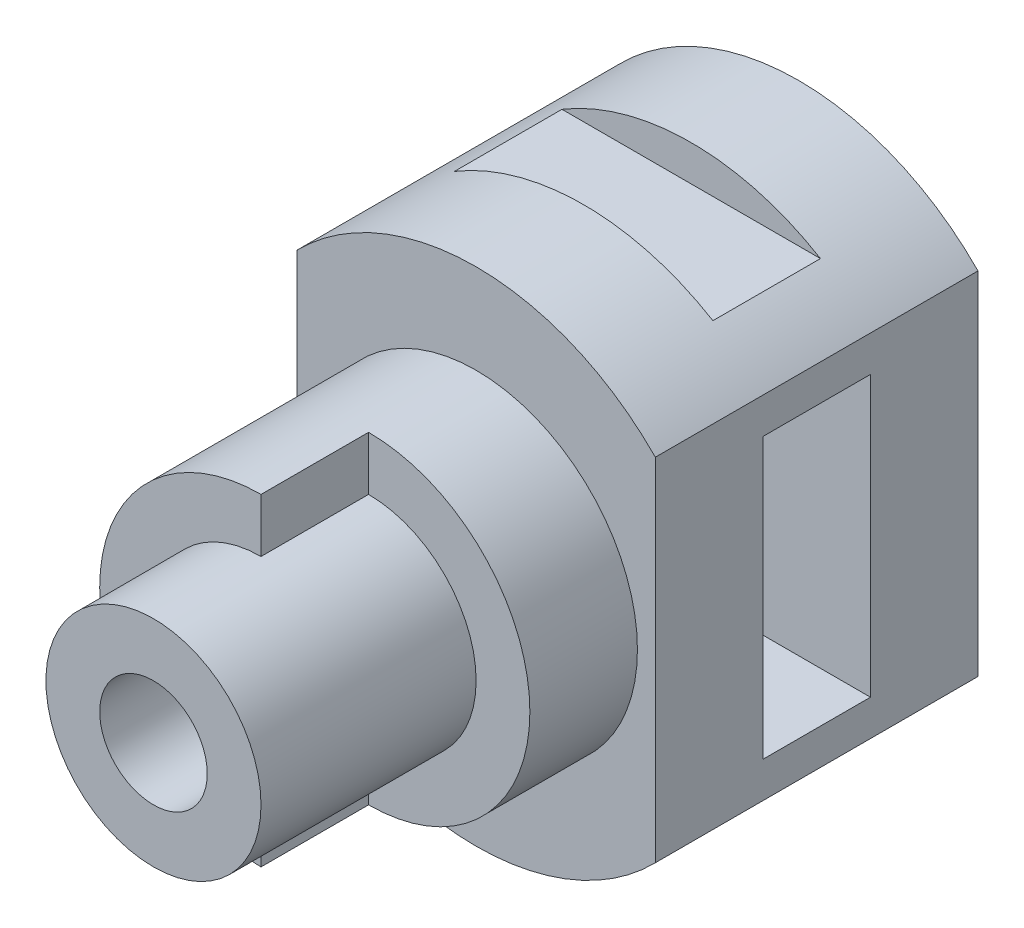
ISO-10303-21;
HEADER;
FILE_DESCRIPTION(('STEP AP214'),'2;1');
FILE_NAME('part.step','',(''),(''),'','','');
FILE_SCHEMA(('AUTOMOTIVE_DESIGN { 1 0 10303 214 1 1 1 1 }'));
ENDSEC;
DATA;
#1=APPLICATION_CONTEXT('core data for automotive mechanical design processes');
#2=APPLICATION_PROTOCOL_DEFINITION('international standard','automotive_design',2000,#1);
#3=PRODUCT_CONTEXT('',#1,'mechanical');
#4=PRODUCT('Part','Part','',(#3));
#5=PRODUCT_RELATED_PRODUCT_CATEGORY('part','',(#4));
#6=PRODUCT_DEFINITION_FORMATION('','',#4);
#7=PRODUCT_DEFINITION_CONTEXT('part definition',#1,'design');
#8=PRODUCT_DEFINITION('design','',#6,#7);
#9=PRODUCT_DEFINITION_SHAPE('','',#8);
#10=(LENGTH_UNIT() NAMED_UNIT(*) SI_UNIT(.MILLI.,.METRE.));
#11=(NAMED_UNIT(*) PLANE_ANGLE_UNIT() SI_UNIT($,.RADIAN.));
#12=(NAMED_UNIT(*) SI_UNIT($,.STERADIAN.) SOLID_ANGLE_UNIT());
#13=UNCERTAINTY_MEASURE_WITH_UNIT(LENGTH_MEASURE(1.E-05),#10,'distance_accuracy_value','');
#14=(GEOMETRIC_REPRESENTATION_CONTEXT(3) GLOBAL_UNCERTAINTY_ASSIGNED_CONTEXT((#13)) GLOBAL_UNIT_ASSIGNED_CONTEXT((#10,
#11,#12)) REPRESENTATION_CONTEXT('',''));
#15=CARTESIAN_POINT('',(0.,0.,0.));
#16=DIRECTION('',(0.,0.,1.));
#17=DIRECTION('',(1.,0.,0.));
#18=AXIS2_PLACEMENT_3D('',#15,#16,#17);
#19=CARTESIAN_POINT('',(5.,0.,9.));
#20=DIRECTION('',(-1.,0.,0.));
#21=DIRECTION('',(0.,0.,1.));
#22=AXIS2_PLACEMENT_3D('',#19,#20,#21);
#23=PLANE('',#22);
#24=DIRECTION('',(0.,1.,0.));
#25=VECTOR('',#24,1.);
#26=CARTESIAN_POINT('',(5.,0.,0.));
#27=LINE('',#26,#25);
#28=CARTESIAN_POINT('',(5.,-4.89897948556636,0.));
#29=VERTEX_POINT('',#28);
#30=CARTESIAN_POINT('',(5.,4.89897948556636,0.));
#31=VERTEX_POINT('',#30);
#32=EDGE_CURVE('E241',#29,#31,#27,.T.);
#33=ORIENTED_EDGE('',*,*,#32,.T.);
#34=DIRECTION('',(0.,0.,-1.));
#35=VECTOR('',#34,1.);
#36=CARTESIAN_POINT('',(5.,4.89897948556636,9.));
#37=LINE('',#36,#35);
#38=CARTESIAN_POINT('',(5.,4.89897948556636,9.));
#39=VERTEX_POINT('',#38);
#40=EDGE_CURVE('E266',#39,#31,#37,.T.);
#41=ORIENTED_EDGE('',*,*,#40,.F.);
#42=DIRECTION('',(0.,1.,0.));
#43=VECTOR('',#42,1.);
#44=CARTESIAN_POINT('',(5.,0.,9.));
#45=LINE('',#44,#43);
#46=CARTESIAN_POINT('',(5.,-4.89897948556636,9.));
#47=VERTEX_POINT('',#46);
#48=EDGE_CURVE('E242',#47,#39,#45,.T.);
#49=ORIENTED_EDGE('',*,*,#48,.F.);
#50=DIRECTION('',(0.,0.,-1.));
#51=VECTOR('',#50,1.);
#52=CARTESIAN_POINT('',(5.,-4.89897948556636,9.));
#53=LINE('',#52,#51);
#54=EDGE_CURVE('E257',#47,#29,#53,.T.);
#55=ORIENTED_EDGE('',*,*,#54,.T.);
#56=EDGE_LOOP('',(#33,#41,#49,#55));
#57=FACE_BOUND('',#56,.T.);
#58=DIRECTION('',(0.,-1.,0.));
#59=VECTOR('',#58,1.);
#60=CARTESIAN_POINT('',(5.,0.,6.));
#61=LINE('',#60,#59);
#62=CARTESIAN_POINT('',(5.,3.89897948556636,6.));
#63=VERTEX_POINT('',#62);
#64=CARTESIAN_POINT('',(5.,-3.89897948556636,6.));
#65=VERTEX_POINT('',#64);
#66=EDGE_CURVE('E239',#63,#65,#61,.T.);
#67=ORIENTED_EDGE('',*,*,#66,.F.);
#68=DIRECTION('',(0.,0.,1.));
#69=VECTOR('',#68,1.);
#70=CARTESIAN_POINT('',(5.,3.89897948556636,9.));
#71=LINE('',#70,#69);
#72=CARTESIAN_POINT('',(5.,3.89897948556636,3.));
#73=VERTEX_POINT('',#72);
#74=EDGE_CURVE('E203',#73,#63,#71,.T.);
#75=ORIENTED_EDGE('',*,*,#74,.F.);
#76=DIRECTION('',(0.,-1.,0.));
#77=VECTOR('',#76,1.);
#78=CARTESIAN_POINT('',(5.,0.,3.));
#79=LINE('',#78,#77);
#80=CARTESIAN_POINT('',(5.,-3.89897948556636,3.));
#81=VERTEX_POINT('',#80);
#82=EDGE_CURVE('E233',#73,#81,#79,.T.);
#83=ORIENTED_EDGE('',*,*,#82,.T.);
#84=DIRECTION('',(0.,0.,1.));
#85=VECTOR('',#84,1.);
#86=CARTESIAN_POINT('',(5.,-3.89897948556636,9.));
#87=LINE('',#86,#85);
#88=EDGE_CURVE('E236',#81,#65,#87,.T.);
#89=ORIENTED_EDGE('',*,*,#88,.T.);
#90=EDGE_LOOP('',(#67,#75,#83,#89));
#91=FACE_BOUND('',#90,.T.);
#92=ADVANCED_FACE('F35',(#57,#91),#23,.F.);
#93=CARTESIAN_POINT('',(0.,0.,9.));
#94=DIRECTION('',(0.,0.,-1.));
#95=DIRECTION('',(-1.,0.,0.));
#96=AXIS2_PLACEMENT_3D('',#93,#94,#95);
#97=CYLINDRICAL_SURFACE('',#96,7.);
#98=CARTESIAN_POINT('',(0.,0.,0.));
#99=DIRECTION('',(0.,0.,1.));
#100=DIRECTION('',(1.,0.,0.));
#101=AXIS2_PLACEMENT_3D('',#98,#99,#100);
#102=CIRCLE('',#101,7.);
#103=CARTESIAN_POINT('',(-5.,4.89897948556636,0.));
#104=VERTEX_POINT('',#103);
#105=EDGE_CURVE('E253',#31,#104,#102,.T.);
#106=ORIENTED_EDGE('',*,*,#105,.T.);
#107=DIRECTION('',(0.,0.,-1.));
#108=VECTOR('',#107,1.);
#109=CARTESIAN_POINT('',(-5.,4.89897948556636,9.));
#110=LINE('',#109,#108);
#111=CARTESIAN_POINT('',(-5.,4.89897948556636,9.));
#112=VERTEX_POINT('',#111);
#113=EDGE_CURVE('E263',#112,#104,#110,.T.);
#114=ORIENTED_EDGE('',*,*,#113,.F.);
#115=CARTESIAN_POINT('',(0.,0.,9.));
#116=DIRECTION('',(0.,0.,1.));
#117=DIRECTION('',(1.,0.,0.));
#118=AXIS2_PLACEMENT_3D('',#115,#116,#117);
#119=CIRCLE('',#118,7.);
#120=EDGE_CURVE('E245',#39,#112,#119,.T.);
#121=ORIENTED_EDGE('',*,*,#120,.F.);
#122=ORIENTED_EDGE('',*,*,#40,.T.);
#123=EDGE_LOOP('',(#106,#114,#121,#122));
#124=FACE_BOUND('',#123,.T.);
#125=DIRECTION('',(0.,0.,-1.));
#126=VECTOR('',#125,1.);
#127=CARTESIAN_POINT('',(-3.60555127546399,6.,9.));
#128=LINE('',#127,#126);
#129=CARTESIAN_POINT('',(-3.60555127546399,6.,6.));
#130=VERTEX_POINT('',#129);
#131=CARTESIAN_POINT('',(-3.60555127546399,6.,3.));
#132=VERTEX_POINT('',#131);
#133=EDGE_CURVE('E38',#130,#132,#128,.T.);
#134=ORIENTED_EDGE('',*,*,#133,.T.);
#135=CARTESIAN_POINT('',(0.,0.,3.));
#136=DIRECTION('',(0.,0.,-1.));
#137=DIRECTION('',(-1.,0.,0.));
#138=AXIS2_PLACEMENT_3D('',#135,#136,#137);
#139=CIRCLE('',#138,7.);
#140=CARTESIAN_POINT('',(3.60555127546399,6.,3.));
#141=VERTEX_POINT('',#140);
#142=EDGE_CURVE('E280',#132,#141,#139,.T.);
#143=ORIENTED_EDGE('',*,*,#142,.T.);
#144=DIRECTION('',(0.,0.,-1.));
#145=VECTOR('',#144,1.);
#146=CARTESIAN_POINT('',(3.60555127546399,6.,9.));
#147=LINE('',#146,#145);
#148=CARTESIAN_POINT('',(3.60555127546399,6.,6.));
#149=VERTEX_POINT('',#148);
#150=EDGE_CURVE('E283',#141,#149,#147,.F.);
#151=ORIENTED_EDGE('',*,*,#150,.T.);
#152=CARTESIAN_POINT('',(0.,0.,6.));
#153=DIRECTION('',(0.,0.,-1.));
#154=DIRECTION('',(-1.,0.,0.));
#155=AXIS2_PLACEMENT_3D('',#152,#153,#154);
#156=CIRCLE('',#155,7.);
#157=EDGE_CURVE('E285',#130,#149,#156,.T.);
#158=ORIENTED_EDGE('',*,*,#157,.F.);
#159=EDGE_LOOP('',(#134,#143,#151,#158));
#160=FACE_BOUND('',#159,.T.);
#161=ADVANCED_FACE('F291',(#124,#160),#97,.T.);
#162=CARTESIAN_POINT('',(-5.,0.,9.));
#163=DIRECTION('',(1.,0.,0.));
#164=DIRECTION('',(0.,0.,-1.));
#165=AXIS2_PLACEMENT_3D('',#162,#163,#164);
#166=PLANE('',#165);
#167=DIRECTION('',(0.,-1.,0.));
#168=VECTOR('',#167,1.);
#169=CARTESIAN_POINT('',(-5.,0.,0.));
#170=LINE('',#169,#168);
#171=CARTESIAN_POINT('',(-5.,-4.89897948556636,0.));
#172=VERTEX_POINT('',#171);
#173=EDGE_CURVE('E255',#104,#172,#170,.T.);
#174=ORIENTED_EDGE('',*,*,#173,.T.);
#175=DIRECTION('',(0.,0.,-1.));
#176=VECTOR('',#175,1.);
#177=CARTESIAN_POINT('',(-5.,-4.89897948556636,9.));
#178=LINE('',#177,#176);
#179=CARTESIAN_POINT('',(-5.,-4.89897948556636,9.));
#180=VERTEX_POINT('',#179);
#181=EDGE_CURVE('E260',#180,#172,#178,.T.);
#182=ORIENTED_EDGE('',*,*,#181,.F.);
#183=DIRECTION('',(0.,-1.,0.));
#184=VECTOR('',#183,1.);
#185=CARTESIAN_POINT('',(-5.,0.,9.));
#186=LINE('',#185,#184);
#187=EDGE_CURVE('E248',#112,#180,#186,.T.);
#188=ORIENTED_EDGE('',*,*,#187,.F.);
#189=ORIENTED_EDGE('',*,*,#113,.T.);
#190=EDGE_LOOP('',(#174,#182,#188,#189));
#191=FACE_BOUND('',#190,.T.);
#192=DIRECTION('',(0.,-1.,0.));
#193=VECTOR('',#192,1.);
#194=CARTESIAN_POINT('',(-5.,0.,6.));
#195=LINE('',#194,#193);
#196=CARTESIAN_POINT('',(-5.,3.89897948556636,6.));
#197=VERTEX_POINT('',#196);
#198=CARTESIAN_POINT('',(-5.,-3.89897948556636,6.));
#199=VERTEX_POINT('',#198);
#200=EDGE_CURVE('E208',#197,#199,#195,.T.);
#201=ORIENTED_EDGE('',*,*,#200,.T.);
#202=DIRECTION('',(0.,0.,1.));
#203=VECTOR('',#202,1.);
#204=CARTESIAN_POINT('',(-5.,-3.89897948556636,0.));
#205=LINE('',#204,#203);
#206=CARTESIAN_POINT('',(-5.,-3.89897948556636,3.));
#207=VERTEX_POINT('',#206);
#208=EDGE_CURVE('E218',#207,#199,#205,.T.);
#209=ORIENTED_EDGE('',*,*,#208,.F.);
#210=DIRECTION('',(0.,-1.,0.));
#211=VECTOR('',#210,1.);
#212=CARTESIAN_POINT('',(-5.,0.,3.));
#213=LINE('',#212,#211);
#214=CARTESIAN_POINT('',(-5.,3.89897948556636,3.));
#215=VERTEX_POINT('',#214);
#216=EDGE_CURVE('E215',#215,#207,#213,.T.);
#217=ORIENTED_EDGE('',*,*,#216,.F.);
#218=DIRECTION('',(0.,0.,1.));
#219=VECTOR('',#218,1.);
#220=CARTESIAN_POINT('',(-5.,3.89897948556636,0.));
#221=LINE('',#220,#219);
#222=EDGE_CURVE('E211',#215,#197,#221,.T.);
#223=ORIENTED_EDGE('',*,*,#222,.T.);
#224=EDGE_LOOP('',(#201,#209,#217,#223));
#225=FACE_BOUND('',#224,.T.);
#226=ADVANCED_FACE('F314',(#191,#225),#166,.F.);
#227=EDGE_CURVE('E246',#172,#29,#102,.T.);
#228=ORIENTED_EDGE('',*,*,#227,.T.);
#229=ORIENTED_EDGE('',*,*,#54,.F.);
#230=EDGE_CURVE('E249',#180,#47,#119,.T.);
#231=ORIENTED_EDGE('',*,*,#230,.F.);
#232=ORIENTED_EDGE('',*,*,#181,.T.);
#233=EDGE_LOOP('',(#228,#229,#231,#232));
#234=FACE_BOUND('',#233,.T.);
#235=CARTESIAN_POINT('',(0.,0.,3.));
#236=DIRECTION('',(0.,0.,1.));
#237=DIRECTION('',(1.,0.,0.));
#238=AXIS2_PLACEMENT_3D('',#235,#236,#237);
#239=CIRCLE('',#238,7.);
#240=CARTESIAN_POINT('',(-3.60555127546399,-6.,3.));
#241=VERTEX_POINT('',#240);
#242=CARTESIAN_POINT('',(3.60555127546399,-6.,3.));
#243=VERTEX_POINT('',#242);
#244=EDGE_CURVE('E278',#241,#243,#239,.T.);
#245=ORIENTED_EDGE('',*,*,#244,.F.);
#246=DIRECTION('',(0.,0.,-1.));
#247=VECTOR('',#246,1.);
#248=CARTESIAN_POINT('',(-3.60555127546399,-6.,9.));
#249=LINE('',#248,#247);
#250=CARTESIAN_POINT('',(-3.60555127546399,-6.,6.));
#251=VERTEX_POINT('',#250);
#252=EDGE_CURVE('E275',#251,#241,#249,.T.);
#253=ORIENTED_EDGE('',*,*,#252,.F.);
#254=CARTESIAN_POINT('',(0.,0.,6.));
#255=DIRECTION('',(0.,0.,1.));
#256=DIRECTION('',(1.,0.,0.));
#257=AXIS2_PLACEMENT_3D('',#254,#255,#256);
#258=CIRCLE('',#257,7.);
#259=CARTESIAN_POINT('',(3.60555127546399,-6.,6.));
#260=VERTEX_POINT('',#259);
#261=EDGE_CURVE('E269',#251,#260,#258,.T.);
#262=ORIENTED_EDGE('',*,*,#261,.T.);
#263=DIRECTION('',(0.,0.,-1.));
#264=VECTOR('',#263,1.);
#265=CARTESIAN_POINT('',(3.60555127546399,-6.,9.));
#266=LINE('',#265,#264);
#267=EDGE_CURVE('E272',#243,#260,#266,.F.);
#268=ORIENTED_EDGE('',*,*,#267,.F.);
#269=EDGE_LOOP('',(#245,#253,#262,#268));
#270=FACE_BOUND('',#269,.T.);
#271=ADVANCED_FACE('F317',(#234,#270),#97,.T.);
#272=CARTESIAN_POINT('',(0.,0.,9.));
#273=DIRECTION('',(0.,0.,1.));
#274=DIRECTION('',(1.,0.,0.));
#275=AXIS2_PLACEMENT_3D('',#272,#273,#274);
#276=PLANE('',#275);
#277=CARTESIAN_POINT('',(0.,0.,9.));
#278=DIRECTION('',(0.,0.,1.));
#279=DIRECTION('',(1.,0.,0.));
#280=AXIS2_PLACEMENT_3D('',#277,#278,#279);
#281=CIRCLE('',#280,4.5);
#282=CARTESIAN_POINT('',(4.5,0.,9.));
#283=VERTEX_POINT('',#282);
#284=EDGE_CURVE('E43',#283,#283,#281,.T.);
#285=ORIENTED_EDGE('',*,*,#284,.F.);
#286=EDGE_LOOP('',(#285));
#287=FACE_BOUND('',#286,.T.);
#288=ORIENTED_EDGE('',*,*,#48,.T.);
#289=ORIENTED_EDGE('',*,*,#120,.T.);
#290=ORIENTED_EDGE('',*,*,#187,.T.);
#291=ORIENTED_EDGE('',*,*,#230,.T.);
#292=EDGE_LOOP('',(#288,#289,#290,#291));
#293=FACE_BOUND('',#292,.T.);
#294=ADVANCED_FACE('F355',(#287,#293),#276,.T.);
#295=CARTESIAN_POINT('',(0.,0.,0.));
#296=DIRECTION('',(0.,0.,1.));
#297=DIRECTION('',(1.,0.,0.));
#298=AXIS2_PLACEMENT_3D('',#295,#296,#297);
#299=PLANE('',#298);
#300=ORIENTED_EDGE('',*,*,#32,.F.);
#301=ORIENTED_EDGE('',*,*,#227,.F.);
#302=ORIENTED_EDGE('',*,*,#173,.F.);
#303=ORIENTED_EDGE('',*,*,#105,.F.);
#304=EDGE_LOOP('',(#300,#301,#302,#303));
#305=FACE_BOUND('',#304,.T.);
#306=ADVANCED_FACE('F347',(#305),#299,.F.);
#307=CARTESIAN_POINT('',(14.,0.,3.));
#308=DIRECTION('',(0.,0.,1.));
#309=DIRECTION('',(1.,0.,0.));
#310=AXIS2_PLACEMENT_3D('',#307,#308,#309);
#311=PLANE('',#310);
#312=DIRECTION('',(-1.,0.,0.));
#313=VECTOR('',#312,1.);
#314=CARTESIAN_POINT('',(14.,-6.,3.));
#315=LINE('',#314,#313);
#316=EDGE_CURVE('E212',#243,#241,#315,.T.);
#317=ORIENTED_EDGE('',*,*,#316,.T.);
#318=ORIENTED_EDGE('',*,*,#244,.T.);
#319=EDGE_LOOP('',(#317,#318));
#320=FACE_BOUND('',#319,.T.);
#321=ADVANCED_FACE('F343',(#320),#311,.T.);
#322=CARTESIAN_POINT('',(14.,-6.,0.));
#323=DIRECTION('',(0.,-1.,0.));
#324=DIRECTION('',(0.,0.,-1.));
#325=AXIS2_PLACEMENT_3D('',#322,#323,#324);
#326=PLANE('',#325);
#327=ORIENTED_EDGE('',*,*,#252,.T.);
#328=ORIENTED_EDGE('',*,*,#316,.F.);
#329=ORIENTED_EDGE('',*,*,#267,.T.);
#330=DIRECTION('',(-1.,0.,0.));
#331=VECTOR('',#330,1.);
#332=CARTESIAN_POINT('',(14.,-6.,6.));
#333=LINE('',#332,#331);
#334=EDGE_CURVE('E197',#260,#251,#333,.T.);
#335=ORIENTED_EDGE('',*,*,#334,.T.);
#336=EDGE_LOOP('',(#327,#328,#329,#335));
#337=FACE_BOUND('',#336,.T.);
#338=ADVANCED_FACE('F346',(#337),#326,.T.);
#339=CARTESIAN_POINT('',(14.,0.,6.));
#340=DIRECTION('',(0.,0.,1.));
#341=DIRECTION('',(1.,0.,0.));
#342=AXIS2_PLACEMENT_3D('',#339,#340,#341);
#343=PLANE('',#342);
#344=ORIENTED_EDGE('',*,*,#334,.F.);
#345=ORIENTED_EDGE('',*,*,#261,.F.);
#346=EDGE_LOOP('',(#344,#345));
#347=FACE_BOUND('',#346,.T.);
#348=ADVANCED_FACE('F342',(#347),#343,.F.);
#349=CARTESIAN_POINT('',(14.,0.,6.));
#350=DIRECTION('',(0.,0.,-1.));
#351=DIRECTION('',(0.,1.,0.));
#352=AXIS2_PLACEMENT_3D('',#349,#350,#351);
#353=PLANE('',#352);
#354=ORIENTED_EDGE('',*,*,#66,.T.);
#355=DIRECTION('',(-1.,0.,0.));
#356=VECTOR('',#355,1.);
#357=CARTESIAN_POINT('',(14.,-3.89897948556636,6.));
#358=LINE('',#357,#356);
#359=EDGE_CURVE('E207',#65,#199,#358,.T.);
#360=ORIENTED_EDGE('',*,*,#359,.T.);
#361=ORIENTED_EDGE('',*,*,#200,.F.);
#362=DIRECTION('',(-1.,0.,0.));
#363=VECTOR('',#362,1.);
#364=CARTESIAN_POINT('',(14.,3.89897948556636,6.));
#365=LINE('',#364,#363);
#366=EDGE_CURVE('E221',#63,#197,#365,.T.);
#367=ORIENTED_EDGE('',*,*,#366,.F.);
#368=EDGE_LOOP('',(#354,#360,#361,#367));
#369=FACE_BOUND('',#368,.T.);
#370=ADVANCED_FACE('F326',(#369),#353,.T.);
#371=CARTESIAN_POINT('',(14.,-3.89897948556636,0.));
#372=DIRECTION('',(0.,-1.,0.));
#373=DIRECTION('',(0.,0.,-1.));
#374=AXIS2_PLACEMENT_3D('',#371,#372,#373);
#375=PLANE('',#374);
#376=DIRECTION('',(-1.,0.,0.));
#377=VECTOR('',#376,1.);
#378=CARTESIAN_POINT('',(14.,-3.89897948556636,3.));
#379=LINE('',#378,#377);
#380=EDGE_CURVE('E223',#81,#207,#379,.T.);
#381=ORIENTED_EDGE('',*,*,#380,.T.);
#382=ORIENTED_EDGE('',*,*,#208,.T.);
#383=ORIENTED_EDGE('',*,*,#359,.F.);
#384=ORIENTED_EDGE('',*,*,#88,.F.);
#385=EDGE_LOOP('',(#381,#382,#383,#384));
#386=FACE_BOUND('',#385,.T.);
#387=ADVANCED_FACE('F328',(#386),#375,.F.);
#388=CARTESIAN_POINT('',(14.,0.,3.));
#389=DIRECTION('',(0.,0.,-1.));
#390=DIRECTION('',(0.,1.,0.));
#391=AXIS2_PLACEMENT_3D('',#388,#389,#390);
#392=PLANE('',#391);
#393=DIRECTION('',(-1.,0.,0.));
#394=VECTOR('',#393,1.);
#395=CARTESIAN_POINT('',(14.,3.89897948556636,3.));
#396=LINE('',#395,#394);
#397=EDGE_CURVE('E59',#73,#215,#396,.T.);
#398=ORIENTED_EDGE('',*,*,#397,.T.);
#399=ORIENTED_EDGE('',*,*,#216,.T.);
#400=ORIENTED_EDGE('',*,*,#380,.F.);
#401=ORIENTED_EDGE('',*,*,#82,.F.);
#402=EDGE_LOOP('',(#398,#399,#400,#401));
#403=FACE_BOUND('',#402,.T.);
#404=ADVANCED_FACE('F305',(#403),#392,.F.);
#405=CARTESIAN_POINT('',(14.,3.89897948556636,0.));
#406=DIRECTION('',(0.,-1.,0.));
#407=DIRECTION('',(0.,0.,-1.));
#408=AXIS2_PLACEMENT_3D('',#405,#406,#407);
#409=PLANE('',#408);
#410=ORIENTED_EDGE('',*,*,#74,.T.);
#411=ORIENTED_EDGE('',*,*,#366,.T.);
#412=ORIENTED_EDGE('',*,*,#222,.F.);
#413=ORIENTED_EDGE('',*,*,#397,.F.);
#414=EDGE_LOOP('',(#410,#411,#412,#413));
#415=FACE_BOUND('',#414,.T.);
#416=ADVANCED_FACE('F297',(#415),#409,.T.);
#417=CARTESIAN_POINT('',(14.,0.,6.));
#418=DIRECTION('',(0.,0.,-1.));
#419=DIRECTION('',(-1.,0.,0.));
#420=AXIS2_PLACEMENT_3D('',#417,#418,#419);
#421=PLANE('',#420);
#422=DIRECTION('',(-1.,0.,0.));
#423=VECTOR('',#422,1.);
#424=CARTESIAN_POINT('',(14.,6.,6.));
#425=LINE('',#424,#423);
#426=EDGE_CURVE('E200',#149,#130,#425,.T.);
#427=ORIENTED_EDGE('',*,*,#426,.T.);
#428=ORIENTED_EDGE('',*,*,#157,.T.);
#429=EDGE_LOOP('',(#427,#428));
#430=FACE_BOUND('',#429,.T.);
#431=ADVANCED_FACE('F295',(#430),#421,.T.);
#432=CARTESIAN_POINT('',(14.,6.,0.));
#433=DIRECTION('',(0.,-1.,0.));
#434=DIRECTION('',(0.,0.,-1.));
#435=AXIS2_PLACEMENT_3D('',#432,#433,#434);
#436=PLANE('',#435);
#437=ORIENTED_EDGE('',*,*,#426,.F.);
#438=ORIENTED_EDGE('',*,*,#150,.F.);
#439=DIRECTION('',(-1.,0.,0.));
#440=VECTOR('',#439,1.);
#441=CARTESIAN_POINT('',(14.,6.,3.));
#442=LINE('',#441,#440);
#443=EDGE_CURVE('E204',#141,#132,#442,.T.);
#444=ORIENTED_EDGE('',*,*,#443,.T.);
#445=ORIENTED_EDGE('',*,*,#133,.F.);
#446=EDGE_LOOP('',(#437,#438,#444,#445));
#447=FACE_BOUND('',#446,.T.);
#448=ADVANCED_FACE('F293',(#447),#436,.F.);
#449=CARTESIAN_POINT('',(14.,0.,3.));
#450=DIRECTION('',(0.,0.,-1.));
#451=DIRECTION('',(-1.,0.,0.));
#452=AXIS2_PLACEMENT_3D('',#449,#450,#451);
#453=PLANE('',#452);
#454=ORIENTED_EDGE('',*,*,#443,.F.);
#455=ORIENTED_EDGE('',*,*,#142,.F.);
#456=EDGE_LOOP('',(#454,#455));
#457=FACE_BOUND('',#456,.T.);
#458=ADVANCED_FACE('F303',(#457),#453,.F.);
#459=CARTESIAN_POINT('',(0.,0.,15.));
#460=DIRECTION('',(0.,0.,-1.));
#461=DIRECTION('',(-1.,0.,0.));
#462=AXIS2_PLACEMENT_3D('',#459,#460,#461);
#463=CYLINDRICAL_SURFACE('',#462,4.5);
#464=CARTESIAN_POINT('',(0.,0.,15.));
#465=DIRECTION('',(0.,0.,1.));
#466=DIRECTION('',(1.,0.,0.));
#467=AXIS2_PLACEMENT_3D('',#464,#465,#466);
#468=CIRCLE('',#467,4.5);
#469=CARTESIAN_POINT('',(0.,4.5,15.));
#470=VERTEX_POINT('',#469);
#471=CARTESIAN_POINT('',(0.,-4.5,15.));
#472=VERTEX_POINT('',#471);
#473=EDGE_CURVE('E193',#470,#472,#468,.T.);
#474=ORIENTED_EDGE('',*,*,#473,.F.);
#475=DIRECTION('',(0.,0.,1.));
#476=VECTOR('',#475,1.);
#477=CARTESIAN_POINT('',(0.,4.5,12.));
#478=LINE('',#477,#476);
#479=CARTESIAN_POINT('',(0.,4.5,12.));
#480=VERTEX_POINT('',#479);
#481=EDGE_CURVE('E183',#480,#470,#478,.T.);
#482=ORIENTED_EDGE('',*,*,#481,.F.);
#483=CARTESIAN_POINT('',(0.,0.,12.));
#484=DIRECTION('',(0.,0.,1.));
#485=DIRECTION('',(-1.,0.,0.));
#486=AXIS2_PLACEMENT_3D('',#483,#484,#485);
#487=CIRCLE('',#486,4.5);
#488=CARTESIAN_POINT('',(0.,-4.5,12.));
#489=VERTEX_POINT('',#488);
#490=EDGE_CURVE('E169',#489,#480,#487,.T.);
#491=ORIENTED_EDGE('',*,*,#490,.F.);
#492=DIRECTION('',(0.,0.,1.));
#493=VECTOR('',#492,1.);
#494=CARTESIAN_POINT('',(0.,-4.5,12.));
#495=LINE('',#494,#493);
#496=EDGE_CURVE('E160',#489,#472,#495,.T.);
#497=ORIENTED_EDGE('',*,*,#496,.T.);
#498=EDGE_LOOP('',(#474,#482,#491,#497));
#499=FACE_BOUND('',#498,.T.);
#500=ORIENTED_EDGE('',*,*,#284,.T.);
#501=EDGE_LOOP('',(#500));
#502=FACE_BOUND('',#501,.T.);
#503=ADVANCED_FACE('F441',(#499,#502),#463,.T.);
#504=CARTESIAN_POINT('',(0.,0.,15.));
#505=DIRECTION('',(0.,0.,1.));
#506=DIRECTION('',(1.,0.,0.));
#507=AXIS2_PLACEMENT_3D('',#504,#505,#506);
#508=PLANE('',#507);
#509=DIRECTION('',(0.,-1.,0.));
#510=VECTOR('',#509,1.);
#511=CARTESIAN_POINT('',(0.,4.5,15.));
#512=LINE('',#511,#510);
#513=CARTESIAN_POINT('',(0.,3.,15.));
#514=VERTEX_POINT('',#513);
#515=EDGE_CURVE('E51',#470,#514,#512,.T.);
#516=ORIENTED_EDGE('',*,*,#515,.F.);
#517=ORIENTED_EDGE('',*,*,#473,.T.);
#518=DIRECTION('',(0.,-1.,0.));
#519=VECTOR('',#518,1.);
#520=CARTESIAN_POINT('',(0.,-3.,15.));
#521=LINE('',#520,#519);
#522=CARTESIAN_POINT('',(0.,-3.,15.));
#523=VERTEX_POINT('',#522);
#524=EDGE_CURVE('E174',#523,#472,#521,.T.);
#525=ORIENTED_EDGE('',*,*,#524,.F.);
#526=CARTESIAN_POINT('',(0.,0.,15.));
#527=DIRECTION('',(0.,0.,1.));
#528=DIRECTION('',(1.,0.,0.));
#529=AXIS2_PLACEMENT_3D('',#526,#527,#528);
#530=CIRCLE('',#529,3.);
#531=EDGE_CURVE('E11',#514,#523,#530,.T.);
#532=ORIENTED_EDGE('',*,*,#531,.F.);
#533=EDGE_LOOP('',(#516,#517,#525,#532));
#534=FACE_BOUND('',#533,.T.);
#535=ADVANCED_FACE('F451',(#534),#508,.T.);
#536=CARTESIAN_POINT('',(0.,0.,18.));
#537=DIRECTION('',(0.,0.,-1.));
#538=DIRECTION('',(-1.,0.,0.));
#539=AXIS2_PLACEMENT_3D('',#536,#537,#538);
#540=CYLINDRICAL_SURFACE('',#539,3.);
#541=CARTESIAN_POINT('',(0.,0.,18.));
#542=DIRECTION('',(0.,0.,1.));
#543=DIRECTION('',(1.,0.,0.));
#544=AXIS2_PLACEMENT_3D('',#541,#542,#543);
#545=CIRCLE('',#544,3.);
#546=CARTESIAN_POINT('',(3.,0.,18.));
#547=VERTEX_POINT('',#546);
#548=EDGE_CURVE('E191',#547,#547,#545,.T.);
#549=ORIENTED_EDGE('',*,*,#548,.F.);
#550=EDGE_LOOP('',(#549));
#551=FACE_BOUND('',#550,.T.);
#552=ORIENTED_EDGE('',*,*,#531,.T.);
#553=DIRECTION('',(0.,0.,1.));
#554=VECTOR('',#553,1.);
#555=CARTESIAN_POINT('',(0.,-3.,12.));
#556=LINE('',#555,#554);
#557=CARTESIAN_POINT('',(0.,-3.,12.));
#558=VERTEX_POINT('',#557);
#559=EDGE_CURVE('E151',#558,#523,#556,.T.);
#560=ORIENTED_EDGE('',*,*,#559,.F.);
#561=CARTESIAN_POINT('',(0.,0.,12.));
#562=DIRECTION('',(0.,0.,-1.));
#563=DIRECTION('',(-1.,0.,0.));
#564=AXIS2_PLACEMENT_3D('',#561,#562,#563);
#565=CIRCLE('',#564,3.);
#566=CARTESIAN_POINT('',(0.,3.,12.));
#567=VERTEX_POINT('',#566);
#568=EDGE_CURVE('E155',#567,#558,#565,.T.);
#569=ORIENTED_EDGE('',*,*,#568,.F.);
#570=DIRECTION('',(0.,0.,1.));
#571=VECTOR('',#570,1.);
#572=CARTESIAN_POINT('',(0.,3.,12.));
#573=LINE('',#572,#571);
#574=EDGE_CURVE('E180',#567,#514,#573,.T.);
#575=ORIENTED_EDGE('',*,*,#574,.T.);
#576=EDGE_LOOP('',(#552,#560,#569,#575));
#577=FACE_BOUND('',#576,.T.);
#578=ADVANCED_FACE('F153',(#551,#577),#540,.T.);
#579=CARTESIAN_POINT('',(0.,0.,18.));
#580=DIRECTION('',(0.,0.,1.));
#581=DIRECTION('',(1.,0.,0.));
#582=AXIS2_PLACEMENT_3D('',#579,#580,#581);
#583=PLANE('',#582);
#584=CARTESIAN_POINT('',(0.,0.,18.));
#585=DIRECTION('',(0.,0.,1.));
#586=DIRECTION('',(1.,0.,0.));
#587=AXIS2_PLACEMENT_3D('',#584,#585,#586);
#588=CIRCLE('',#587,1.5);
#589=CARTESIAN_POINT('',(1.5,0.,18.));
#590=VERTEX_POINT('',#589);
#591=EDGE_CURVE('E182',#590,#590,#588,.T.);
#592=ORIENTED_EDGE('',*,*,#591,.F.);
#593=EDGE_LOOP('',(#592));
#594=FACE_BOUND('',#593,.T.);
#595=ORIENTED_EDGE('',*,*,#548,.T.);
#596=EDGE_LOOP('',(#595));
#597=FACE_BOUND('',#596,.T.);
#598=ADVANCED_FACE('F469',(#594,#597),#583,.T.);
#599=CARTESIAN_POINT('',(0.,0.,14.));
#600=DIRECTION('',(0.,0.,1.));
#601=DIRECTION('',(1.,0.,0.));
#602=AXIS2_PLACEMENT_3D('',#599,#600,#601);
#603=CONICAL_SURFACE('',#602,1.5,1.02974425867665);
#604=CARTESIAN_POINT('',(0.,0.,13.0987090714587));
#605=VERTEX_POINT('',#604);
#606=VERTEX_LOOP('',#605);
#607=FACE_BOUND('',#606,.T.);
#608=CARTESIAN_POINT('',(0.,0.,14.));
#609=DIRECTION('',(0.,0.,1.));
#610=DIRECTION('',(1.,0.,0.));
#611=AXIS2_PLACEMENT_3D('',#608,#609,#610);
#612=CIRCLE('',#611,1.5);
#613=CARTESIAN_POINT('',(1.5,0.,14.));
#614=VERTEX_POINT('',#613);
#615=EDGE_CURVE('E188',#614,#614,#612,.T.);
#616=ORIENTED_EDGE('',*,*,#615,.T.);
#617=EDGE_LOOP('',(#616));
#618=FACE_BOUND('',#617,.T.);
#619=ADVANCED_FACE('F473',(#607,#618),#603,.F.);
#620=CARTESIAN_POINT('',(0.,0.,18.));
#621=DIRECTION('',(0.,0.,1.));
#622=DIRECTION('',(1.,0.,0.));
#623=AXIS2_PLACEMENT_3D('',#620,#621,#622);
#624=CYLINDRICAL_SURFACE('',#623,1.5);
#625=ORIENTED_EDGE('',*,*,#615,.F.);
#626=EDGE_LOOP('',(#625));
#627=FACE_BOUND('',#626,.T.);
#628=ORIENTED_EDGE('',*,*,#591,.T.);
#629=EDGE_LOOP('',(#628));
#630=FACE_BOUND('',#629,.T.);
#631=ADVANCED_FACE('F483',(#627,#630),#624,.F.);
#632=CARTESIAN_POINT('',(0.,4.5,12.));
#633=DIRECTION('',(-1.,0.,0.));
#634=DIRECTION('',(0.,0.,1.));
#635=AXIS2_PLACEMENT_3D('',#632,#633,#634);
#636=PLANE('',#635);
#637=ORIENTED_EDGE('',*,*,#515,.T.);
#638=ORIENTED_EDGE('',*,*,#574,.F.);
#639=DIRECTION('',(0.,-1.,0.));
#640=VECTOR('',#639,1.);
#641=CARTESIAN_POINT('',(0.,4.5,12.));
#642=LINE('',#641,#640);
#643=EDGE_CURVE('E161',#480,#567,#642,.T.);
#644=ORIENTED_EDGE('',*,*,#643,.F.);
#645=ORIENTED_EDGE('',*,*,#481,.T.);
#646=EDGE_LOOP('',(#637,#638,#644,#645));
#647=FACE_BOUND('',#646,.T.);
#648=ADVANCED_FACE('F489',(#647),#636,.F.);
#649=CARTESIAN_POINT('',(0.,-3.,12.));
#650=DIRECTION('',(-1.,0.,0.));
#651=DIRECTION('',(0.,0.,1.));
#652=AXIS2_PLACEMENT_3D('',#649,#650,#651);
#653=PLANE('',#652);
#654=ORIENTED_EDGE('',*,*,#524,.T.);
#655=ORIENTED_EDGE('',*,*,#496,.F.);
#656=DIRECTION('',(0.,-1.,0.));
#657=VECTOR('',#656,1.);
#658=CARTESIAN_POINT('',(0.,-3.,12.));
#659=LINE('',#658,#657);
#660=EDGE_CURVE('E164',#558,#489,#659,.T.);
#661=ORIENTED_EDGE('',*,*,#660,.F.);
#662=ORIENTED_EDGE('',*,*,#559,.T.);
#663=EDGE_LOOP('',(#654,#655,#661,#662));
#664=FACE_BOUND('',#663,.T.);
#665=ADVANCED_FACE('F165',(#664),#653,.F.);
#666=CARTESIAN_POINT('',(0.,0.,12.));
#667=DIRECTION('',(0.,0.,-1.));
#668=DIRECTION('',(-1.,0.,0.));
#669=AXIS2_PLACEMENT_3D('',#666,#667,#668);
#670=PLANE('',#669);
#671=ORIENTED_EDGE('',*,*,#568,.T.);
#672=ORIENTED_EDGE('',*,*,#660,.T.);
#673=ORIENTED_EDGE('',*,*,#490,.T.);
#674=ORIENTED_EDGE('',*,*,#643,.T.);
#675=EDGE_LOOP('',(#671,#672,#673,#674));
#676=FACE_BOUND('',#675,.T.);
#677=ADVANCED_FACE('F171',(#676),#670,.F.);
#678=CLOSED_SHELL('',(#92,#161,#226,#271,#294,#306,#321,#338,#348,#370,#387,#404,#416,#431,#448,
#458,#503,#535,#578,#598,#619,#631,#648,#665,#677));
#679=MANIFOLD_SOLID_BREP('B2',#678);
#680=ADVANCED_BREP_SHAPE_REPRESENTATION('',(#18,#679),#14);
#681=SHAPE_DEFINITION_REPRESENTATION(#9,#680);
ENDSEC;
END-ISO-10303-21;
